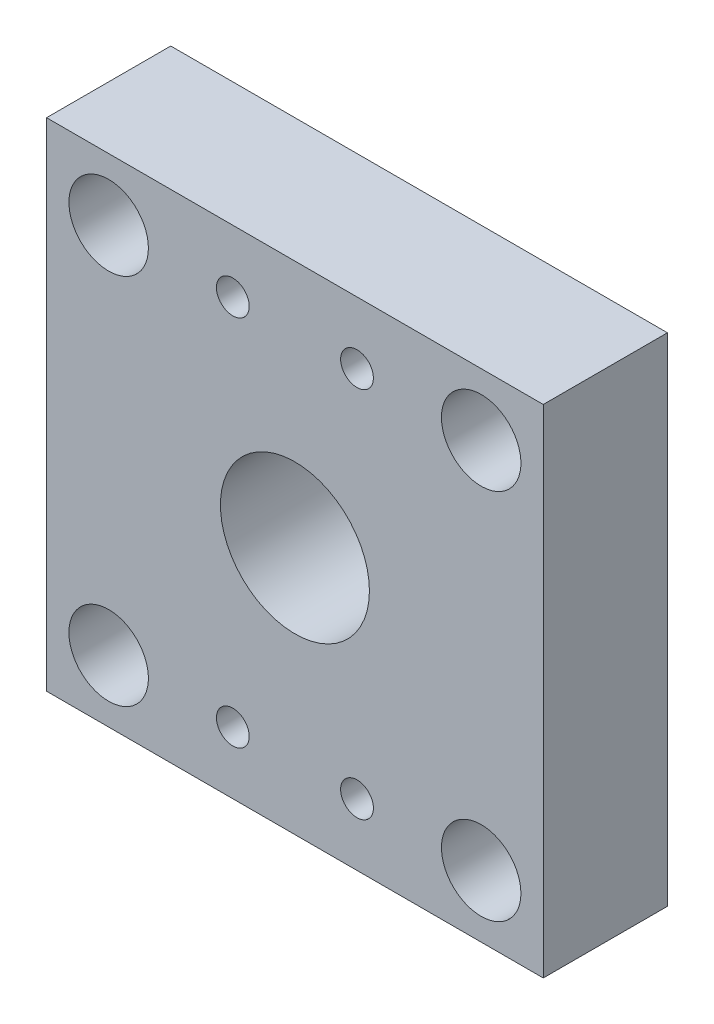
ISO-10303-21;
HEADER;
FILE_DESCRIPTION(('STEP AP214'),'2;1');
FILE_NAME('part.step','',(''),(''),'','','');
FILE_SCHEMA(('AUTOMOTIVE_DESIGN { 1 0 10303 214 1 1 1 1 }'));
ENDSEC;
DATA;
#1=APPLICATION_CONTEXT('core data for automotive mechanical design processes');
#2=APPLICATION_PROTOCOL_DEFINITION('international standard','automotive_design',2000,#1);
#3=PRODUCT_CONTEXT('',#1,'mechanical');
#4=PRODUCT('Part','Part','',(#3));
#5=PRODUCT_RELATED_PRODUCT_CATEGORY('part','',(#4));
#6=PRODUCT_DEFINITION_FORMATION('','',#4);
#7=PRODUCT_DEFINITION_CONTEXT('part definition',#1,'design');
#8=PRODUCT_DEFINITION('design','',#6,#7);
#9=PRODUCT_DEFINITION_SHAPE('','',#8);
#10=(LENGTH_UNIT() NAMED_UNIT(*) SI_UNIT(.MILLI.,.METRE.));
#11=(NAMED_UNIT(*) PLANE_ANGLE_UNIT() SI_UNIT($,.RADIAN.));
#12=(NAMED_UNIT(*) SI_UNIT($,.STERADIAN.) SOLID_ANGLE_UNIT());
#13=UNCERTAINTY_MEASURE_WITH_UNIT(LENGTH_MEASURE(1.E-05),#10,'distance_accuracy_value','');
#14=(GEOMETRIC_REPRESENTATION_CONTEXT(3) GLOBAL_UNCERTAINTY_ASSIGNED_CONTEXT((#13)) GLOBAL_UNIT_ASSIGNED_CONTEXT((#10,
#11,#12)) REPRESENTATION_CONTEXT('',''));
#15=CARTESIAN_POINT('',(0.,0.,0.));
#16=DIRECTION('',(0.,0.,1.));
#17=DIRECTION('',(1.,0.,0.));
#18=AXIS2_PLACEMENT_3D('',#15,#16,#17);
#19=CARTESIAN_POINT('',(0.,0.,12.7));
#20=DIRECTION('',(1.,0.,0.));
#21=DIRECTION('',(0.,0.,-1.));
#22=AXIS2_PLACEMENT_3D('',#19,#20,#21);
#23=PLANE('',#22);
#24=DIRECTION('',(0.,-1.,0.));
#25=VECTOR('',#24,1.);
#26=CARTESIAN_POINT('',(0.,0.,0.));
#27=LINE('',#26,#25);
#28=CARTESIAN_POINT('',(0.,50.8,0.));
#29=VERTEX_POINT('',#28);
#30=CARTESIAN_POINT('',(0.,0.,0.));
#31=VERTEX_POINT('',#30);
#32=EDGE_CURVE('E97',#29,#31,#27,.T.);
#33=ORIENTED_EDGE('',*,*,#32,.T.);
#34=DIRECTION('',(0.,0.,-1.));
#35=VECTOR('',#34,1.);
#36=CARTESIAN_POINT('',(0.,0.,12.7));
#37=LINE('',#36,#35);
#38=CARTESIAN_POINT('',(0.,0.,12.7));
#39=VERTEX_POINT('',#38);
#40=EDGE_CURVE('E11',#39,#31,#37,.T.);
#41=ORIENTED_EDGE('',*,*,#40,.F.);
#42=DIRECTION('',(0.,-1.,0.));
#43=VECTOR('',#42,1.);
#44=CARTESIAN_POINT('',(0.,0.,12.7));
#45=LINE('',#44,#43);
#46=CARTESIAN_POINT('',(0.,50.8,12.7));
#47=VERTEX_POINT('',#46);
#48=EDGE_CURVE('E85',#47,#39,#45,.T.);
#49=ORIENTED_EDGE('',*,*,#48,.F.);
#50=DIRECTION('',(0.,0.,-1.));
#51=VECTOR('',#50,1.);
#52=CARTESIAN_POINT('',(0.,50.8,12.7));
#53=LINE('',#52,#51);
#54=EDGE_CURVE('E93',#47,#29,#53,.T.);
#55=ORIENTED_EDGE('',*,*,#54,.T.);
#56=EDGE_LOOP('',(#33,#41,#49,#55));
#57=FACE_BOUND('',#56,.T.);
#58=ADVANCED_FACE('F34',(#57),#23,.F.);
#59=CARTESIAN_POINT('',(0.,0.,12.7));
#60=DIRECTION('',(0.,1.,0.));
#61=DIRECTION('',(0.,0.,1.));
#62=AXIS2_PLACEMENT_3D('',#59,#60,#61);
#63=PLANE('',#62);
#64=DIRECTION('',(1.,0.,0.));
#65=VECTOR('',#64,1.);
#66=CARTESIAN_POINT('',(0.,0.,0.));
#67=LINE('',#66,#65);
#68=CARTESIAN_POINT('',(50.8,0.,0.));
#69=VERTEX_POINT('',#68);
#70=EDGE_CURVE('E89',#31,#69,#67,.T.);
#71=ORIENTED_EDGE('',*,*,#70,.T.);
#72=DIRECTION('',(0.,0.,-1.));
#73=VECTOR('',#72,1.);
#74=CARTESIAN_POINT('',(50.8,0.,12.7));
#75=LINE('',#74,#73);
#76=CARTESIAN_POINT('',(50.8,0.,12.7));
#77=VERTEX_POINT('',#76);
#78=EDGE_CURVE('E42',#77,#69,#75,.T.);
#79=ORIENTED_EDGE('',*,*,#78,.F.);
#80=DIRECTION('',(1.,0.,0.));
#81=VECTOR('',#80,1.);
#82=CARTESIAN_POINT('',(0.,0.,12.7));
#83=LINE('',#82,#81);
#84=EDGE_CURVE('E80',#39,#77,#83,.T.);
#85=ORIENTED_EDGE('',*,*,#84,.F.);
#86=ORIENTED_EDGE('',*,*,#40,.T.);
#87=EDGE_LOOP('',(#71,#79,#85,#86));
#88=FACE_BOUND('',#87,.T.);
#89=ADVANCED_FACE('F88',(#88),#63,.F.);
#90=CARTESIAN_POINT('',(50.8,0.,12.7));
#91=DIRECTION('',(-1.,0.,0.));
#92=DIRECTION('',(0.,0.,1.));
#93=AXIS2_PLACEMENT_3D('',#90,#91,#92);
#94=PLANE('',#93);
#95=DIRECTION('',(0.,1.,0.));
#96=VECTOR('',#95,1.);
#97=CARTESIAN_POINT('',(50.8,0.,0.));
#98=LINE('',#97,#96);
#99=CARTESIAN_POINT('',(50.8,50.8,0.));
#100=VERTEX_POINT('',#99);
#101=EDGE_CURVE('E67',#69,#100,#98,.T.);
#102=ORIENTED_EDGE('',*,*,#101,.T.);
#103=DIRECTION('',(0.,0.,-1.));
#104=VECTOR('',#103,1.);
#105=CARTESIAN_POINT('',(50.8,50.8,12.7));
#106=LINE('',#105,#104);
#107=CARTESIAN_POINT('',(50.8,50.8,12.7));
#108=VERTEX_POINT('',#107);
#109=EDGE_CURVE('E90',#108,#100,#106,.T.);
#110=ORIENTED_EDGE('',*,*,#109,.F.);
#111=DIRECTION('',(0.,1.,0.));
#112=VECTOR('',#111,1.);
#113=CARTESIAN_POINT('',(50.8,0.,12.7));
#114=LINE('',#113,#112);
#115=EDGE_CURVE('E83',#77,#108,#114,.T.);
#116=ORIENTED_EDGE('',*,*,#115,.F.);
#117=ORIENTED_EDGE('',*,*,#78,.T.);
#118=EDGE_LOOP('',(#102,#110,#116,#117));
#119=FACE_BOUND('',#118,.T.);
#120=ADVANCED_FACE('F91',(#119),#94,.F.);
#121=CARTESIAN_POINT('',(0.,50.8,12.7));
#122=DIRECTION('',(0.,-1.,0.));
#123=DIRECTION('',(0.,0.,-1.));
#124=AXIS2_PLACEMENT_3D('',#121,#122,#123);
#125=PLANE('',#124);
#126=DIRECTION('',(-1.,0.,0.));
#127=VECTOR('',#126,1.);
#128=CARTESIAN_POINT('',(0.,50.8,0.));
#129=LINE('',#128,#127);
#130=EDGE_CURVE('E73',#100,#29,#129,.T.);
#131=ORIENTED_EDGE('',*,*,#130,.T.);
#132=ORIENTED_EDGE('',*,*,#54,.F.);
#133=DIRECTION('',(-1.,0.,0.));
#134=VECTOR('',#133,1.);
#135=CARTESIAN_POINT('',(0.,50.8,12.7));
#136=LINE('',#135,#134);
#137=EDGE_CURVE('E50',#108,#47,#136,.T.);
#138=ORIENTED_EDGE('',*,*,#137,.F.);
#139=ORIENTED_EDGE('',*,*,#109,.T.);
#140=EDGE_LOOP('',(#131,#132,#138,#139));
#141=FACE_BOUND('',#140,.T.);
#142=ADVANCED_FACE('F105',(#141),#125,.F.);
#143=CARTESIAN_POINT('',(0.,0.,12.7));
#144=DIRECTION('',(0.,0.,-1.));
#145=DIRECTION('',(-1.,0.,0.));
#146=AXIS2_PLACEMENT_3D('',#143,#144,#145);
#147=PLANE('',#146);
#148=CARTESIAN_POINT('',(31.75,6.35000000000001,12.7));
#149=DIRECTION('',(0.,0.,1.));
#150=DIRECTION('',(1.,0.,0.));
#151=AXIS2_PLACEMENT_3D('',#148,#149,#150);
#152=CIRCLE('',#151,1.6764);
#153=CARTESIAN_POINT('',(33.4264,6.35000000000001,12.7));
#154=VERTEX_POINT('',#153);
#155=EDGE_CURVE('E159',#154,#154,#152,.T.);
#156=ORIENTED_EDGE('',*,*,#155,.F.);
#157=EDGE_LOOP('',(#156));
#158=FACE_BOUND('',#157,.T.);
#159=CARTESIAN_POINT('',(19.05,6.35000000000001,12.7));
#160=DIRECTION('',(0.,0.,1.));
#161=DIRECTION('',(-1.,0.,0.));
#162=AXIS2_PLACEMENT_3D('',#159,#160,#161);
#163=CIRCLE('',#162,1.6764);
#164=CARTESIAN_POINT('',(17.3736,6.35000000000001,12.7));
#165=VERTEX_POINT('',#164);
#166=EDGE_CURVE('E153',#165,#165,#163,.T.);
#167=ORIENTED_EDGE('',*,*,#166,.F.);
#168=EDGE_LOOP('',(#167));
#169=FACE_BOUND('',#168,.T.);
#170=CARTESIAN_POINT('',(31.75,44.45,12.7));
#171=DIRECTION('',(0.,0.,1.));
#172=DIRECTION('',(-1.,0.,0.));
#173=AXIS2_PLACEMENT_3D('',#170,#171,#172);
#174=CIRCLE('',#173,1.6764);
#175=CARTESIAN_POINT('',(30.0736,44.45,12.7));
#176=VERTEX_POINT('',#175);
#177=EDGE_CURVE('E147',#176,#176,#174,.T.);
#178=ORIENTED_EDGE('',*,*,#177,.F.);
#179=EDGE_LOOP('',(#178));
#180=FACE_BOUND('',#179,.T.);
#181=CARTESIAN_POINT('',(19.05,44.45,12.7));
#182=DIRECTION('',(0.,0.,1.));
#183=DIRECTION('',(1.,0.,0.));
#184=AXIS2_PLACEMENT_3D('',#181,#182,#183);
#185=CIRCLE('',#184,1.6764);
#186=CARTESIAN_POINT('',(20.7264,44.45,12.7));
#187=VERTEX_POINT('',#186);
#188=EDGE_CURVE('E141',#187,#187,#185,.T.);
#189=ORIENTED_EDGE('',*,*,#188,.F.);
#190=EDGE_LOOP('',(#189));
#191=FACE_BOUND('',#190,.T.);
#192=CARTESIAN_POINT('',(44.45,6.35000000000001,12.7));
#193=DIRECTION('',(0.,0.,1.));
#194=DIRECTION('',(1.,0.,0.));
#195=AXIS2_PLACEMENT_3D('',#192,#193,#194);
#196=CIRCLE('',#195,4.064);
#197=CARTESIAN_POINT('',(48.514,6.35000000000001,12.7));
#198=VERTEX_POINT('',#197);
#199=EDGE_CURVE('E135',#198,#198,#196,.T.);
#200=ORIENTED_EDGE('',*,*,#199,.F.);
#201=EDGE_LOOP('',(#200));
#202=FACE_BOUND('',#201,.T.);
#203=CARTESIAN_POINT('',(44.45,44.45,12.7));
#204=DIRECTION('',(0.,0.,1.));
#205=DIRECTION('',(-1.,0.,0.));
#206=AXIS2_PLACEMENT_3D('',#203,#204,#205);
#207=CIRCLE('',#206,4.064);
#208=CARTESIAN_POINT('',(40.386,44.45,12.7));
#209=VERTEX_POINT('',#208);
#210=EDGE_CURVE('E129',#209,#209,#207,.T.);
#211=ORIENTED_EDGE('',*,*,#210,.F.);
#212=EDGE_LOOP('',(#211));
#213=FACE_BOUND('',#212,.T.);
#214=CARTESIAN_POINT('',(6.35,6.35000000000001,12.7));
#215=DIRECTION('',(0.,0.,1.));
#216=DIRECTION('',(-1.,0.,0.));
#217=AXIS2_PLACEMENT_3D('',#214,#215,#216);
#218=CIRCLE('',#217,4.064);
#219=CARTESIAN_POINT('',(2.286,6.35000000000001,12.7));
#220=VERTEX_POINT('',#219);
#221=EDGE_CURVE('E123',#220,#220,#218,.T.);
#222=ORIENTED_EDGE('',*,*,#221,.F.);
#223=EDGE_LOOP('',(#222));
#224=FACE_BOUND('',#223,.T.);
#225=CARTESIAN_POINT('',(6.35,44.45,12.7));
#226=DIRECTION('',(0.,0.,1.));
#227=DIRECTION('',(1.,0.,0.));
#228=AXIS2_PLACEMENT_3D('',#225,#226,#227);
#229=CIRCLE('',#228,4.064);
#230=CARTESIAN_POINT('',(10.414,44.45,12.7));
#231=VERTEX_POINT('',#230);
#232=EDGE_CURVE('E117',#231,#231,#229,.T.);
#233=ORIENTED_EDGE('',*,*,#232,.F.);
#234=EDGE_LOOP('',(#233));
#235=FACE_BOUND('',#234,.T.);
#236=CARTESIAN_POINT('',(25.4,25.4,12.7));
#237=DIRECTION('',(0.,0.,1.));
#238=DIRECTION('',(1.,0.,0.));
#239=AXIS2_PLACEMENT_3D('',#236,#237,#238);
#240=CIRCLE('',#239,7.62);
#241=CARTESIAN_POINT('',(33.02,25.4,12.7));
#242=VERTEX_POINT('',#241);
#243=EDGE_CURVE('E111',#242,#242,#240,.T.);
#244=ORIENTED_EDGE('',*,*,#243,.F.);
#245=EDGE_LOOP('',(#244));
#246=FACE_BOUND('',#245,.T.);
#247=ORIENTED_EDGE('',*,*,#48,.T.);
#248=ORIENTED_EDGE('',*,*,#84,.T.);
#249=ORIENTED_EDGE('',*,*,#115,.T.);
#250=ORIENTED_EDGE('',*,*,#137,.T.);
#251=EDGE_LOOP('',(#247,#248,#249,#250));
#252=FACE_BOUND('',#251,.T.);
#253=ADVANCED_FACE('F81',(#158,#169,#180,#191,#202,#213,#224,#235,#246,#252),#147,.F.);
#254=CARTESIAN_POINT('',(0.,0.,0.));
#255=DIRECTION('',(0.,0.,-1.));
#256=DIRECTION('',(-1.,0.,0.));
#257=AXIS2_PLACEMENT_3D('',#254,#255,#256);
#258=PLANE('',#257);
#259=CARTESIAN_POINT('',(31.75,6.35000000000001,0.));
#260=DIRECTION('',(0.,0.,1.));
#261=DIRECTION('',(1.,0.,0.));
#262=AXIS2_PLACEMENT_3D('',#259,#260,#261);
#263=CIRCLE('',#262,1.6764);
#264=CARTESIAN_POINT('',(33.4264,6.35000000000001,0.));
#265=VERTEX_POINT('',#264);
#266=EDGE_CURVE('E156',#265,#265,#263,.T.);
#267=ORIENTED_EDGE('',*,*,#266,.T.);
#268=EDGE_LOOP('',(#267));
#269=FACE_BOUND('',#268,.T.);
#270=CARTESIAN_POINT('',(19.05,6.35000000000001,0.));
#271=DIRECTION('',(0.,0.,1.));
#272=DIRECTION('',(-1.,0.,0.));
#273=AXIS2_PLACEMENT_3D('',#270,#271,#272);
#274=CIRCLE('',#273,1.6764);
#275=CARTESIAN_POINT('',(17.3736,6.35000000000001,0.));
#276=VERTEX_POINT('',#275);
#277=EDGE_CURVE('E150',#276,#276,#274,.T.);
#278=ORIENTED_EDGE('',*,*,#277,.T.);
#279=EDGE_LOOP('',(#278));
#280=FACE_BOUND('',#279,.T.);
#281=CARTESIAN_POINT('',(31.75,44.45,0.));
#282=DIRECTION('',(0.,0.,1.));
#283=DIRECTION('',(-1.,0.,0.));
#284=AXIS2_PLACEMENT_3D('',#281,#282,#283);
#285=CIRCLE('',#284,1.6764);
#286=CARTESIAN_POINT('',(30.0736,44.45,0.));
#287=VERTEX_POINT('',#286);
#288=EDGE_CURVE('E144',#287,#287,#285,.T.);
#289=ORIENTED_EDGE('',*,*,#288,.T.);
#290=EDGE_LOOP('',(#289));
#291=FACE_BOUND('',#290,.T.);
#292=CARTESIAN_POINT('',(19.05,44.45,0.));
#293=DIRECTION('',(0.,0.,1.));
#294=DIRECTION('',(1.,0.,0.));
#295=AXIS2_PLACEMENT_3D('',#292,#293,#294);
#296=CIRCLE('',#295,1.6764);
#297=CARTESIAN_POINT('',(20.7264,44.45,0.));
#298=VERTEX_POINT('',#297);
#299=EDGE_CURVE('E138',#298,#298,#296,.T.);
#300=ORIENTED_EDGE('',*,*,#299,.T.);
#301=EDGE_LOOP('',(#300));
#302=FACE_BOUND('',#301,.T.);
#303=CARTESIAN_POINT('',(44.45,6.35000000000001,0.));
#304=DIRECTION('',(0.,0.,1.));
#305=DIRECTION('',(1.,0.,0.));
#306=AXIS2_PLACEMENT_3D('',#303,#304,#305);
#307=CIRCLE('',#306,4.064);
#308=CARTESIAN_POINT('',(48.514,6.35000000000001,0.));
#309=VERTEX_POINT('',#308);
#310=EDGE_CURVE('E132',#309,#309,#307,.T.);
#311=ORIENTED_EDGE('',*,*,#310,.T.);
#312=EDGE_LOOP('',(#311));
#313=FACE_BOUND('',#312,.T.);
#314=CARTESIAN_POINT('',(44.45,44.45,0.));
#315=DIRECTION('',(0.,0.,1.));
#316=DIRECTION('',(-1.,0.,0.));
#317=AXIS2_PLACEMENT_3D('',#314,#315,#316);
#318=CIRCLE('',#317,4.064);
#319=CARTESIAN_POINT('',(40.386,44.45,0.));
#320=VERTEX_POINT('',#319);
#321=EDGE_CURVE('E126',#320,#320,#318,.T.);
#322=ORIENTED_EDGE('',*,*,#321,.T.);
#323=EDGE_LOOP('',(#322));
#324=FACE_BOUND('',#323,.T.);
#325=CARTESIAN_POINT('',(6.35,6.35000000000001,0.));
#326=DIRECTION('',(0.,0.,1.));
#327=DIRECTION('',(-1.,0.,0.));
#328=AXIS2_PLACEMENT_3D('',#325,#326,#327);
#329=CIRCLE('',#328,4.064);
#330=CARTESIAN_POINT('',(2.286,6.35000000000001,0.));
#331=VERTEX_POINT('',#330);
#332=EDGE_CURVE('E120',#331,#331,#329,.T.);
#333=ORIENTED_EDGE('',*,*,#332,.T.);
#334=EDGE_LOOP('',(#333));
#335=FACE_BOUND('',#334,.T.);
#336=CARTESIAN_POINT('',(6.35,44.45,0.));
#337=DIRECTION('',(0.,0.,1.));
#338=DIRECTION('',(1.,0.,0.));
#339=AXIS2_PLACEMENT_3D('',#336,#337,#338);
#340=CIRCLE('',#339,4.064);
#341=CARTESIAN_POINT('',(10.414,44.45,0.));
#342=VERTEX_POINT('',#341);
#343=EDGE_CURVE('E114',#342,#342,#340,.T.);
#344=ORIENTED_EDGE('',*,*,#343,.T.);
#345=EDGE_LOOP('',(#344));
#346=FACE_BOUND('',#345,.T.);
#347=CARTESIAN_POINT('',(25.4,25.4,0.));
#348=DIRECTION('',(0.,0.,1.));
#349=DIRECTION('',(1.,0.,0.));
#350=AXIS2_PLACEMENT_3D('',#347,#348,#349);
#351=CIRCLE('',#350,7.62);
#352=CARTESIAN_POINT('',(33.02,25.4,0.));
#353=VERTEX_POINT('',#352);
#354=EDGE_CURVE('E100',#353,#353,#351,.T.);
#355=ORIENTED_EDGE('',*,*,#354,.T.);
#356=EDGE_LOOP('',(#355));
#357=FACE_BOUND('',#356,.T.);
#358=ORIENTED_EDGE('',*,*,#32,.F.);
#359=ORIENTED_EDGE('',*,*,#130,.F.);
#360=ORIENTED_EDGE('',*,*,#101,.F.);
#361=ORIENTED_EDGE('',*,*,#70,.F.);
#362=EDGE_LOOP('',(#358,#359,#360,#361));
#363=FACE_BOUND('',#362,.T.);
#364=ADVANCED_FACE('F108',(#269,#280,#291,#302,#313,#324,#335,#346,#357,#363),#258,.T.);
#365=CARTESIAN_POINT('',(25.4,25.4,0.));
#366=DIRECTION('',(0.,0.,1.));
#367=DIRECTION('',(1.,0.,0.));
#368=AXIS2_PLACEMENT_3D('',#365,#366,#367);
#369=CYLINDRICAL_SURFACE('',#368,7.62);
#370=ORIENTED_EDGE('',*,*,#354,.F.);
#371=EDGE_LOOP('',(#370));
#372=FACE_BOUND('',#371,.T.);
#373=ORIENTED_EDGE('',*,*,#243,.T.);
#374=EDGE_LOOP('',(#373));
#375=FACE_BOUND('',#374,.T.);
#376=ADVANCED_FACE('F193',(#372,#375),#369,.F.);
#377=CARTESIAN_POINT('',(6.35,44.45,0.));
#378=DIRECTION('',(0.,0.,1.));
#379=DIRECTION('',(1.,0.,0.));
#380=AXIS2_PLACEMENT_3D('',#377,#378,#379);
#381=CYLINDRICAL_SURFACE('',#380,4.064);
#382=ORIENTED_EDGE('',*,*,#343,.F.);
#383=EDGE_LOOP('',(#382));
#384=FACE_BOUND('',#383,.T.);
#385=ORIENTED_EDGE('',*,*,#232,.T.);
#386=EDGE_LOOP('',(#385));
#387=FACE_BOUND('',#386,.T.);
#388=ADVANCED_FACE('F195',(#384,#387),#381,.F.);
#389=CARTESIAN_POINT('',(6.35,6.35000000000001,0.));
#390=DIRECTION('',(0.,0.,1.));
#391=DIRECTION('',(1.,0.,0.));
#392=AXIS2_PLACEMENT_3D('',#389,#390,#391);
#393=CYLINDRICAL_SURFACE('',#392,4.064);
#394=ORIENTED_EDGE('',*,*,#332,.F.);
#395=EDGE_LOOP('',(#394));
#396=FACE_BOUND('',#395,.T.);
#397=ORIENTED_EDGE('',*,*,#221,.T.);
#398=EDGE_LOOP('',(#397));
#399=FACE_BOUND('',#398,.T.);
#400=ADVANCED_FACE('F202',(#396,#399),#393,.F.);
#401=CARTESIAN_POINT('',(44.45,44.45,0.));
#402=DIRECTION('',(0.,0.,1.));
#403=DIRECTION('',(1.,0.,0.));
#404=AXIS2_PLACEMENT_3D('',#401,#402,#403);
#405=CYLINDRICAL_SURFACE('',#404,4.064);
#406=ORIENTED_EDGE('',*,*,#321,.F.);
#407=EDGE_LOOP('',(#406));
#408=FACE_BOUND('',#407,.T.);
#409=ORIENTED_EDGE('',*,*,#210,.T.);
#410=EDGE_LOOP('',(#409));
#411=FACE_BOUND('',#410,.T.);
#412=ADVANCED_FACE('F279',(#408,#411),#405,.F.);
#413=CARTESIAN_POINT('',(44.45,6.35000000000001,0.));
#414=DIRECTION('',(0.,0.,1.));
#415=DIRECTION('',(1.,0.,0.));
#416=AXIS2_PLACEMENT_3D('',#413,#414,#415);
#417=CYLINDRICAL_SURFACE('',#416,4.064);
#418=ORIENTED_EDGE('',*,*,#310,.F.);
#419=EDGE_LOOP('',(#418));
#420=FACE_BOUND('',#419,.T.);
#421=ORIENTED_EDGE('',*,*,#199,.T.);
#422=EDGE_LOOP('',(#421));
#423=FACE_BOUND('',#422,.T.);
#424=ADVANCED_FACE('F244',(#420,#423),#417,.F.);
#425=CARTESIAN_POINT('',(19.05,44.45,0.));
#426=DIRECTION('',(0.,0.,1.));
#427=DIRECTION('',(1.,0.,0.));
#428=AXIS2_PLACEMENT_3D('',#425,#426,#427);
#429=CYLINDRICAL_SURFACE('',#428,1.6764);
#430=ORIENTED_EDGE('',*,*,#299,.F.);
#431=EDGE_LOOP('',(#430));
#432=FACE_BOUND('',#431,.T.);
#433=ORIENTED_EDGE('',*,*,#188,.T.);
#434=EDGE_LOOP('',(#433));
#435=FACE_BOUND('',#434,.T.);
#436=ADVANCED_FACE('F238',(#432,#435),#429,.F.);
#437=CARTESIAN_POINT('',(31.75,44.45,0.));
#438=DIRECTION('',(0.,0.,1.));
#439=DIRECTION('',(1.,0.,0.));
#440=AXIS2_PLACEMENT_3D('',#437,#438,#439);
#441=CYLINDRICAL_SURFACE('',#440,1.6764);
#442=ORIENTED_EDGE('',*,*,#288,.F.);
#443=EDGE_LOOP('',(#442));
#444=FACE_BOUND('',#443,.T.);
#445=ORIENTED_EDGE('',*,*,#177,.T.);
#446=EDGE_LOOP('',(#445));
#447=FACE_BOUND('',#446,.T.);
#448=ADVANCED_FACE('F243',(#444,#447),#441,.F.);
#449=CARTESIAN_POINT('',(19.05,6.35000000000001,0.));
#450=DIRECTION('',(0.,0.,1.));
#451=DIRECTION('',(1.,0.,0.));
#452=AXIS2_PLACEMENT_3D('',#449,#450,#451);
#453=CYLINDRICAL_SURFACE('',#452,1.6764);
#454=ORIENTED_EDGE('',*,*,#277,.F.);
#455=EDGE_LOOP('',(#454));
#456=FACE_BOUND('',#455,.T.);
#457=ORIENTED_EDGE('',*,*,#166,.T.);
#458=EDGE_LOOP('',(#457));
#459=FACE_BOUND('',#458,.T.);
#460=ADVANCED_FACE('F170',(#456,#459),#453,.F.);
#461=CARTESIAN_POINT('',(31.75,6.35000000000001,0.));
#462=DIRECTION('',(0.,0.,1.));
#463=DIRECTION('',(1.,0.,0.));
#464=AXIS2_PLACEMENT_3D('',#461,#462,#463);
#465=CYLINDRICAL_SURFACE('',#464,1.6764);
#466=ORIENTED_EDGE('',*,*,#266,.F.);
#467=EDGE_LOOP('',(#466));
#468=FACE_BOUND('',#467,.T.);
#469=ORIENTED_EDGE('',*,*,#155,.T.);
#470=EDGE_LOOP('',(#469));
#471=FACE_BOUND('',#470,.T.);
#472=ADVANCED_FACE('F167',(#468,#471),#465,.F.);
#473=CLOSED_SHELL('',(#58,#89,#120,#142,#253,#364,#376,#388,#400,#412,#424,#436,#448,#460,#472));
#474=MANIFOLD_SOLID_BREP('B2',#473);
#475=ADVANCED_BREP_SHAPE_REPRESENTATION('',(#18,#474),#14);
#476=SHAPE_DEFINITION_REPRESENTATION(#9,#475);
ENDSEC;
END-ISO-10303-21;
